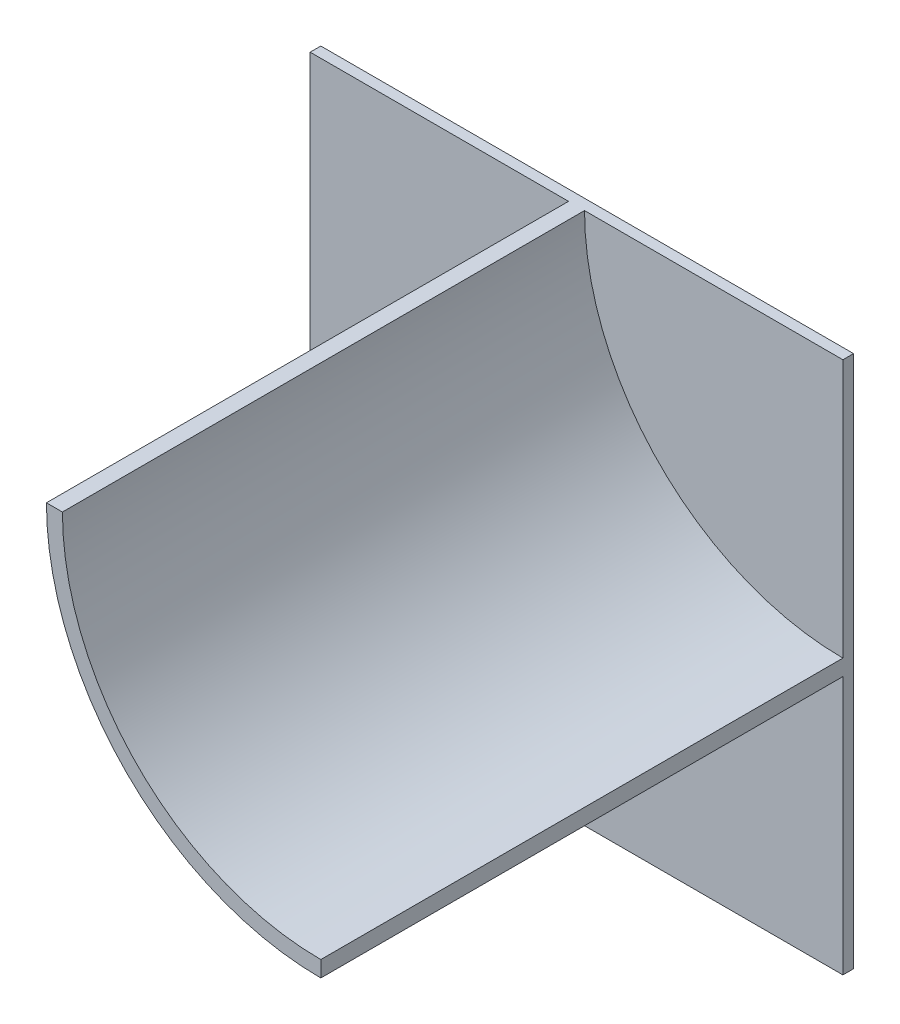
ISO-10303-21;
HEADER;
FILE_DESCRIPTION(('STEP AP214'),'2;1');
FILE_NAME('part.step','',(''),(''),'','','');
FILE_SCHEMA(('AUTOMOTIVE_DESIGN { 1 0 10303 214 1 1 1 1 }'));
ENDSEC;
DATA;
#1=APPLICATION_CONTEXT('core data for automotive mechanical design processes');
#2=APPLICATION_PROTOCOL_DEFINITION('international standard','automotive_design',2000,#1);
#3=PRODUCT_CONTEXT('',#1,'mechanical');
#4=PRODUCT('Part','Part','',(#3));
#5=PRODUCT_RELATED_PRODUCT_CATEGORY('part','',(#4));
#6=PRODUCT_DEFINITION_FORMATION('','',#4);
#7=PRODUCT_DEFINITION_CONTEXT('part definition',#1,'design');
#8=PRODUCT_DEFINITION('design','',#6,#7);
#9=PRODUCT_DEFINITION_SHAPE('','',#8);
#10=(LENGTH_UNIT() NAMED_UNIT(*) SI_UNIT(.MILLI.,.METRE.));
#11=(NAMED_UNIT(*) PLANE_ANGLE_UNIT() SI_UNIT($,.RADIAN.));
#12=(NAMED_UNIT(*) SI_UNIT($,.STERADIAN.) SOLID_ANGLE_UNIT());
#13=UNCERTAINTY_MEASURE_WITH_UNIT(LENGTH_MEASURE(1.E-05),#10,'distance_accuracy_value','');
#14=(GEOMETRIC_REPRESENTATION_CONTEXT(3) GLOBAL_UNCERTAINTY_ASSIGNED_CONTEXT((#13)) GLOBAL_UNIT_ASSIGNED_CONTEXT((#10,
#11,#12)) REPRESENTATION_CONTEXT('',''));
#15=CARTESIAN_POINT('',(0.,0.,0.));
#16=DIRECTION('',(0.,0.,1.));
#17=DIRECTION('',(1.,0.,0.));
#18=AXIS2_PLACEMENT_3D('',#15,#16,#17);
#19=CARTESIAN_POINT('',(0.,0.,4.));
#20=DIRECTION('',(0.,0.,1.));
#21=DIRECTION('',(1.,0.,0.));
#22=AXIS2_PLACEMENT_3D('',#19,#20,#21);
#23=PLANE('',#22);
#24=DIRECTION('',(-1.,0.,0.));
#25=VECTOR('',#24,1.);
#26=CARTESIAN_POINT('',(0.,100.,4.));
#27=LINE('',#26,#25);
#28=CARTESIAN_POINT('',(100.,100.,4.));
#29=VERTEX_POINT('',#28);
#30=CARTESIAN_POINT('',(3.,100.,4.));
#31=VERTEX_POINT('',#30);
#32=EDGE_CURVE('E65',#29,#31,#27,.T.);
#33=ORIENTED_EDGE('',*,*,#32,.T.);
#34=CARTESIAN_POINT('',(100.,100.,4.));
#35=DIRECTION('',(0.,0.,1.));
#36=DIRECTION('',(1.,0.,0.));
#37=AXIS2_PLACEMENT_3D('',#34,#35,#36);
#38=CIRCLE('',#37,97.);
#39=CARTESIAN_POINT('',(100.,3.,4.));
#40=VERTEX_POINT('',#39);
#41=EDGE_CURVE('E127',#31,#40,#38,.T.);
#42=ORIENTED_EDGE('',*,*,#41,.T.);
#43=DIRECTION('',(0.,-1.,0.));
#44=VECTOR('',#43,1.);
#45=CARTESIAN_POINT('',(100.,0.,4.));
#46=LINE('',#45,#44);
#47=EDGE_CURVE('E150',#29,#40,#46,.T.);
#48=ORIENTED_EDGE('',*,*,#47,.F.);
#49=EDGE_LOOP('',(#33,#42,#48));
#50=FACE_BOUND('',#49,.T.);
#51=ADVANCED_FACE('F41',(#50),#23,.T.);
#52=CARTESIAN_POINT('',(0.,-100.,4.));
#53=DIRECTION('',(0.,-1.,0.));
#54=DIRECTION('',(0.,0.,-1.));
#55=AXIS2_PLACEMENT_3D('',#52,#53,#54);
#56=PLANE('',#55);
#57=DIRECTION('',(-1.,0.,0.));
#58=VECTOR('',#57,1.);
#59=CARTESIAN_POINT('',(0.,-100.,0.));
#60=LINE('',#59,#58);
#61=CARTESIAN_POINT('',(100.,-100.,0.));
#62=VERTEX_POINT('',#61);
#63=CARTESIAN_POINT('',(-100.,-100.,0.));
#64=VERTEX_POINT('',#63);
#65=EDGE_CURVE('E133',#62,#64,#60,.T.);
#66=ORIENTED_EDGE('',*,*,#65,.F.);
#67=DIRECTION('',(0.,0.,-1.));
#68=VECTOR('',#67,1.);
#69=CARTESIAN_POINT('',(100.,-100.,4.));
#70=LINE('',#69,#68);
#71=CARTESIAN_POINT('',(100.,-100.,4.));
#72=VERTEX_POINT('',#71);
#73=EDGE_CURVE('E11',#72,#62,#70,.T.);
#74=ORIENTED_EDGE('',*,*,#73,.F.);
#75=DIRECTION('',(-1.,0.,0.));
#76=VECTOR('',#75,1.);
#77=CARTESIAN_POINT('',(0.,-100.,4.));
#78=LINE('',#77,#76);
#79=CARTESIAN_POINT('',(-100.,-100.,4.));
#80=VERTEX_POINT('',#79);
#81=EDGE_CURVE('E144',#72,#80,#78,.T.);
#82=ORIENTED_EDGE('',*,*,#81,.T.);
#83=DIRECTION('',(0.,0.,-1.));
#84=VECTOR('',#83,1.);
#85=CARTESIAN_POINT('',(-100.,-100.,4.));
#86=LINE('',#85,#84);
#87=EDGE_CURVE('E158',#80,#64,#86,.T.);
#88=ORIENTED_EDGE('',*,*,#87,.T.);
#89=EDGE_LOOP('',(#66,#74,#82,#88));
#90=FACE_BOUND('',#89,.T.);
#91=ADVANCED_FACE('F43',(#90),#56,.T.);
#92=CARTESIAN_POINT('',(100.,0.,4.));
#93=DIRECTION('',(1.,0.,0.));
#94=DIRECTION('',(0.,0.,-1.));
#95=AXIS2_PLACEMENT_3D('',#92,#93,#94);
#96=PLANE('',#95);
#97=DIRECTION('',(0.,-1.,0.));
#98=VECTOR('',#97,1.);
#99=CARTESIAN_POINT('',(100.,0.,0.));
#100=LINE('',#99,#98);
#101=CARTESIAN_POINT('',(100.,100.,0.));
#102=VERTEX_POINT('',#101);
#103=EDGE_CURVE('E138',#102,#62,#100,.T.);
#104=ORIENTED_EDGE('',*,*,#103,.F.);
#105=DIRECTION('',(0.,0.,-1.));
#106=VECTOR('',#105,1.);
#107=CARTESIAN_POINT('',(100.,100.,4.));
#108=LINE('',#107,#106);
#109=EDGE_CURVE('E50',#29,#102,#108,.T.);
#110=ORIENTED_EDGE('',*,*,#109,.F.);
#111=ORIENTED_EDGE('',*,*,#47,.T.);
#112=DIRECTION('',(0.,0.,-1.));
#113=VECTOR('',#112,1.);
#114=CARTESIAN_POINT('',(100.,3.,200.));
#115=LINE('',#114,#113);
#116=CARTESIAN_POINT('',(100.,3.,200.));
#117=VERTEX_POINT('',#116);
#118=EDGE_CURVE('E140',#117,#40,#115,.T.);
#119=ORIENTED_EDGE('',*,*,#118,.F.);
#120=DIRECTION('',(0.,1.,0.));
#121=VECTOR('',#120,1.);
#122=CARTESIAN_POINT('',(100.,0.,200.));
#123=LINE('',#122,#121);
#124=CARTESIAN_POINT('',(100.,-3.,200.));
#125=VERTEX_POINT('',#124);
#126=EDGE_CURVE('E117',#125,#117,#123,.T.);
#127=ORIENTED_EDGE('',*,*,#126,.F.);
#128=DIRECTION('',(0.,0.,-1.));
#129=VECTOR('',#128,1.);
#130=CARTESIAN_POINT('',(100.,-3.,200.));
#131=LINE('',#130,#129);
#132=CARTESIAN_POINT('',(100.,-3.,4.));
#133=VERTEX_POINT('',#132);
#134=EDGE_CURVE('E113',#125,#133,#131,.T.);
#135=ORIENTED_EDGE('',*,*,#134,.T.);
#136=EDGE_CURVE('E148',#133,#72,#46,.T.);
#137=ORIENTED_EDGE('',*,*,#136,.T.);
#138=ORIENTED_EDGE('',*,*,#73,.T.);
#139=EDGE_LOOP('',(#104,#110,#111,#119,#127,#135,#137,#138));
#140=FACE_BOUND('',#139,.T.);
#141=ADVANCED_FACE('F181',(#140),#96,.T.);
#142=CARTESIAN_POINT('',(0.,100.,4.));
#143=DIRECTION('',(0.,-1.,0.));
#144=DIRECTION('',(0.,0.,-1.));
#145=AXIS2_PLACEMENT_3D('',#142,#143,#144);
#146=PLANE('',#145);
#147=DIRECTION('',(-1.,0.,0.));
#148=VECTOR('',#147,1.);
#149=CARTESIAN_POINT('',(0.,100.,0.));
#150=LINE('',#149,#148);
#151=CARTESIAN_POINT('',(-100.,100.,0.));
#152=VERTEX_POINT('',#151);
#153=EDGE_CURVE('E163',#102,#152,#150,.T.);
#154=ORIENTED_EDGE('',*,*,#153,.T.);
#155=DIRECTION('',(0.,0.,-1.));
#156=VECTOR('',#155,1.);
#157=CARTESIAN_POINT('',(-100.,100.,4.));
#158=LINE('',#157,#156);
#159=CARTESIAN_POINT('',(-100.,100.,4.));
#160=VERTEX_POINT('',#159);
#161=EDGE_CURVE('E171',#160,#152,#158,.T.);
#162=ORIENTED_EDGE('',*,*,#161,.F.);
#163=CARTESIAN_POINT('',(-2.99999999999999,100.,4.));
#164=VERTEX_POINT('',#163);
#165=EDGE_CURVE('E131',#164,#160,#27,.T.);
#166=ORIENTED_EDGE('',*,*,#165,.F.);
#167=DIRECTION('',(0.,0.,-1.));
#168=VECTOR('',#167,1.);
#169=CARTESIAN_POINT('',(-3.,100.,200.));
#170=LINE('',#169,#168);
#171=CARTESIAN_POINT('',(-3.,100.,200.));
#172=VERTEX_POINT('',#171);
#173=EDGE_CURVE('E111',#172,#164,#170,.T.);
#174=ORIENTED_EDGE('',*,*,#173,.F.);
#175=DIRECTION('',(-1.,0.,0.));
#176=VECTOR('',#175,1.);
#177=CARTESIAN_POINT('',(0.,100.,200.));
#178=LINE('',#177,#176);
#179=CARTESIAN_POINT('',(3.,100.,200.));
#180=VERTEX_POINT('',#179);
#181=EDGE_CURVE('E118',#180,#172,#178,.T.);
#182=ORIENTED_EDGE('',*,*,#181,.F.);
#183=DIRECTION('',(0.,0.,-1.));
#184=VECTOR('',#183,1.);
#185=CARTESIAN_POINT('',(3.,100.,200.));
#186=LINE('',#185,#184);
#187=EDGE_CURVE('E200',#180,#31,#186,.T.);
#188=ORIENTED_EDGE('',*,*,#187,.T.);
#189=ORIENTED_EDGE('',*,*,#32,.F.);
#190=ORIENTED_EDGE('',*,*,#109,.T.);
#191=EDGE_LOOP('',(#154,#162,#166,#174,#182,#188,#189,#190));
#192=FACE_BOUND('',#191,.T.);
#193=ADVANCED_FACE('F129',(#192),#146,.F.);
#194=CARTESIAN_POINT('',(-100.,0.,4.));
#195=DIRECTION('',(1.,0.,0.));
#196=DIRECTION('',(0.,0.,-1.));
#197=AXIS2_PLACEMENT_3D('',#194,#195,#196);
#198=PLANE('',#197);
#199=DIRECTION('',(0.,-1.,0.));
#200=VECTOR('',#199,1.);
#201=CARTESIAN_POINT('',(-100.,0.,0.));
#202=LINE('',#201,#200);
#203=EDGE_CURVE('E149',#152,#64,#202,.T.);
#204=ORIENTED_EDGE('',*,*,#203,.T.);
#205=ORIENTED_EDGE('',*,*,#87,.F.);
#206=DIRECTION('',(0.,-1.,0.));
#207=VECTOR('',#206,1.);
#208=CARTESIAN_POINT('',(-100.,0.,4.));
#209=LINE('',#208,#207);
#210=EDGE_CURVE('E156',#160,#80,#209,.T.);
#211=ORIENTED_EDGE('',*,*,#210,.F.);
#212=ORIENTED_EDGE('',*,*,#161,.T.);
#213=EDGE_LOOP('',(#204,#205,#211,#212));
#214=FACE_BOUND('',#213,.T.);
#215=ADVANCED_FACE('F189',(#214),#198,.F.);
#216=CARTESIAN_POINT('',(100.,100.,4.));
#217=DIRECTION('',(0.,0.,1.));
#218=DIRECTION('',(1.,0.,0.));
#219=AXIS2_PLACEMENT_3D('',#216,#217,#218);
#220=CIRCLE('',#219,103.);
#221=EDGE_CURVE('E57',#164,#133,#220,.T.);
#222=ORIENTED_EDGE('',*,*,#221,.F.);
#223=ORIENTED_EDGE('',*,*,#165,.T.);
#224=ORIENTED_EDGE('',*,*,#210,.T.);
#225=ORIENTED_EDGE('',*,*,#81,.F.);
#226=ORIENTED_EDGE('',*,*,#136,.F.);
#227=EDGE_LOOP('',(#222,#223,#224,#225,#226));
#228=FACE_BOUND('',#227,.T.);
#229=ADVANCED_FACE('F190',(#228),#23,.T.);
#230=CARTESIAN_POINT('',(0.,0.,0.));
#231=DIRECTION('',(0.,0.,1.));
#232=DIRECTION('',(1.,0.,0.));
#233=AXIS2_PLACEMENT_3D('',#230,#231,#232);
#234=PLANE('',#233);
#235=ORIENTED_EDGE('',*,*,#65,.T.);
#236=ORIENTED_EDGE('',*,*,#203,.F.);
#237=ORIENTED_EDGE('',*,*,#153,.F.);
#238=ORIENTED_EDGE('',*,*,#103,.T.);
#239=EDGE_LOOP('',(#235,#236,#237,#238));
#240=FACE_BOUND('',#239,.T.);
#241=ADVANCED_FACE('F180',(#240),#234,.F.);
#242=CARTESIAN_POINT('',(100.,100.,200.));
#243=DIRECTION('',(0.,0.,-1.));
#244=DIRECTION('',(-1.,0.,0.));
#245=AXIS2_PLACEMENT_3D('',#242,#243,#244);
#246=CYLINDRICAL_SURFACE('',#245,103.);
#247=ORIENTED_EDGE('',*,*,#221,.T.);
#248=ORIENTED_EDGE('',*,*,#134,.F.);
#249=CARTESIAN_POINT('',(100.,100.,200.));
#250=DIRECTION('',(0.,0.,1.));
#251=DIRECTION('',(1.,0.,0.));
#252=AXIS2_PLACEMENT_3D('',#249,#250,#251);
#253=CIRCLE('',#252,103.);
#254=EDGE_CURVE('E107',#172,#125,#253,.T.);
#255=ORIENTED_EDGE('',*,*,#254,.F.);
#256=ORIENTED_EDGE('',*,*,#173,.T.);
#257=EDGE_LOOP('',(#247,#248,#255,#256));
#258=FACE_BOUND('',#257,.T.);
#259=ADVANCED_FACE('F109',(#258),#246,.T.);
#260=CARTESIAN_POINT('',(100.,100.,200.));
#261=DIRECTION('',(0.,0.,-1.));
#262=DIRECTION('',(-1.,0.,0.));
#263=AXIS2_PLACEMENT_3D('',#260,#261,#262);
#264=CYLINDRICAL_SURFACE('',#263,97.);
#265=ORIENTED_EDGE('',*,*,#41,.F.);
#266=ORIENTED_EDGE('',*,*,#187,.F.);
#267=CARTESIAN_POINT('',(100.,100.,200.));
#268=DIRECTION('',(0.,0.,1.));
#269=DIRECTION('',(1.,0.,0.));
#270=AXIS2_PLACEMENT_3D('',#267,#268,#269);
#271=CIRCLE('',#270,97.);
#272=EDGE_CURVE('E124',#180,#117,#271,.T.);
#273=ORIENTED_EDGE('',*,*,#272,.T.);
#274=ORIENTED_EDGE('',*,*,#118,.T.);
#275=EDGE_LOOP('',(#265,#266,#273,#274));
#276=FACE_BOUND('',#275,.T.);
#277=ADVANCED_FACE('F209',(#276),#264,.F.);
#278=CARTESIAN_POINT('',(0.,0.,200.));
#279=DIRECTION('',(0.,0.,1.));
#280=DIRECTION('',(1.,0.,0.));
#281=AXIS2_PLACEMENT_3D('',#278,#279,#280);
#282=PLANE('',#281);
#283=ORIENTED_EDGE('',*,*,#181,.T.);
#284=ORIENTED_EDGE('',*,*,#254,.T.);
#285=ORIENTED_EDGE('',*,*,#126,.T.);
#286=ORIENTED_EDGE('',*,*,#272,.F.);
#287=EDGE_LOOP('',(#283,#284,#285,#286));
#288=FACE_BOUND('',#287,.T.);
#289=ADVANCED_FACE('F122',(#288),#282,.T.);
#290=CLOSED_SHELL('',(#51,#91,#141,#193,#215,#229,#241,#259,#277,#289));
#291=MANIFOLD_SOLID_BREP('B2',#290);
#292=ADVANCED_BREP_SHAPE_REPRESENTATION('',(#18,#291),#14);
#293=SHAPE_DEFINITION_REPRESENTATION(#9,#292);
ENDSEC;
END-ISO-10303-21;
